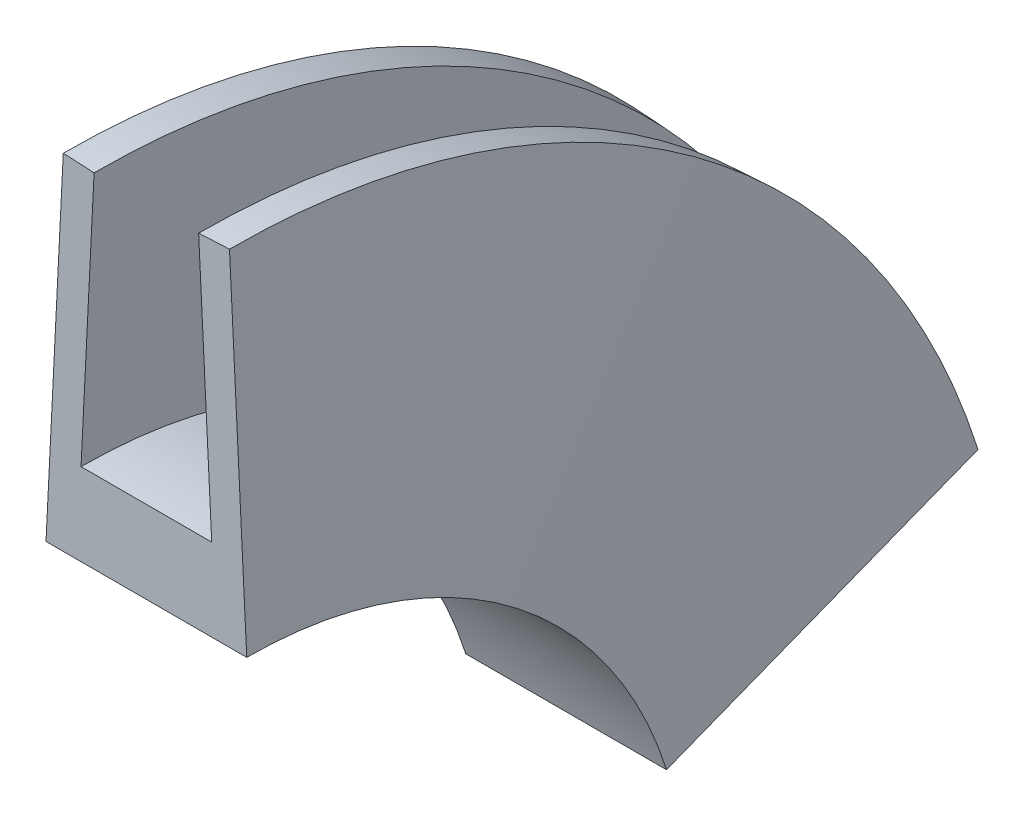
ISO-10303-21;
HEADER;
FILE_DESCRIPTION(('STEP AP214'),'2;1');
FILE_NAME('part.step','',(''),(''),'','','');
FILE_SCHEMA(('AUTOMOTIVE_DESIGN { 1 0 10303 214 1 1 1 1 }'));
ENDSEC;
DATA;
#1=APPLICATION_CONTEXT('core data for automotive mechanical design processes');
#2=APPLICATION_PROTOCOL_DEFINITION('international standard','automotive_design',2000,#1);
#3=PRODUCT_CONTEXT('',#1,'mechanical');
#4=PRODUCT('Part','Part','',(#3));
#5=PRODUCT_RELATED_PRODUCT_CATEGORY('part','',(#4));
#6=PRODUCT_DEFINITION_FORMATION('','',#4);
#7=PRODUCT_DEFINITION_CONTEXT('part definition',#1,'design');
#8=PRODUCT_DEFINITION('design','',#6,#7);
#9=PRODUCT_DEFINITION_SHAPE('','',#8);
#10=(LENGTH_UNIT() NAMED_UNIT(*) SI_UNIT(.MILLI.,.METRE.));
#11=(NAMED_UNIT(*) PLANE_ANGLE_UNIT() SI_UNIT($,.RADIAN.));
#12=(NAMED_UNIT(*) SI_UNIT($,.STERADIAN.) SOLID_ANGLE_UNIT());
#13=UNCERTAINTY_MEASURE_WITH_UNIT(LENGTH_MEASURE(1.E-05),#10,'distance_accuracy_value','');
#14=(GEOMETRIC_REPRESENTATION_CONTEXT(3) GLOBAL_UNCERTAINTY_ASSIGNED_CONTEXT((#13)) GLOBAL_UNIT_ASSIGNED_CONTEXT((#10,
#11,#12)) REPRESENTATION_CONTEXT('',''));
#15=CARTESIAN_POINT('',(0.,0.,0.));
#16=DIRECTION('',(0.,0.,1.));
#17=DIRECTION('',(1.,0.,0.));
#18=AXIS2_PLACEMENT_3D('',#15,#16,#17);
#19=CARTESIAN_POINT('',(0.,0.,0.));
#20=DIRECTION('',(0.,0.,1.));
#21=DIRECTION('',(1.,0.,0.));
#22=AXIS2_PLACEMENT_3D('',#19,#20,#21);
#23=PLANE('',#22);
#24=DIRECTION('',(-0.998749217771909,0.0499999999999996,0.));
#25=VECTOR('',#24,1.);
#26=CARTESIAN_POINT('',(-1.27,6.34205753285162,0.));
#27=LINE('',#26,#25);
#28=CARTESIAN_POINT('',(-1.27,6.34205753285162,0.));
#29=VERTEX_POINT('',#28);
#30=CARTESIAN_POINT('',(-2.01907309932017,6.37955809285162,0.));
#31=VERTEX_POINT('',#30);
#32=EDGE_CURVE('E114',#29,#31,#27,.T.);
#33=ORIENTED_EDGE('',*,*,#32,.T.);
#34=DIRECTION('',(-0.0499999999999999,-0.998749217771909,0.));
#35=VECTOR('',#34,1.);
#36=CARTESIAN_POINT('',(-2.01907309932017,6.37955809285162,0.));
#37=LINE('',#36,#35);
#38=CARTESIAN_POINT('',(-2.43857571037329,-2.,0.));
#39=VERTEX_POINT('',#38);
#40=EDGE_CURVE('E121',#31,#39,#37,.T.);
#41=ORIENTED_EDGE('',*,*,#40,.T.);
#42=DIRECTION('',(1.,0.,0.));
#43=VECTOR('',#42,1.);
#44=CARTESIAN_POINT('',(-2.43857571037329,-2.,0.));
#45=LINE('',#44,#43);
#46=CARTESIAN_POINT('',(2.4385757103733,-2.,0.));
#47=VERTEX_POINT('',#46);
#48=EDGE_CURVE('E131',#39,#47,#45,.T.);
#49=ORIENTED_EDGE('',*,*,#48,.T.);
#50=DIRECTION('',(-0.0500000000000001,0.998749217771909,0.));
#51=VECTOR('',#50,1.);
#52=CARTESIAN_POINT('',(2.4385757103733,-2.,0.));
#53=LINE('',#52,#51);
#54=CARTESIAN_POINT('',(2.01907309932017,6.37955809285162,0.));
#55=VERTEX_POINT('',#54);
#56=EDGE_CURVE('E140',#47,#55,#53,.T.);
#57=ORIENTED_EDGE('',*,*,#56,.T.);
#58=DIRECTION('',(-0.998749217771909,-0.0500000000000008,0.));
#59=VECTOR('',#58,1.);
#60=CARTESIAN_POINT('',(2.01907309932017,6.37955809285162,0.));
#61=LINE('',#60,#59);
#62=CARTESIAN_POINT('',(1.27,6.34205753285162,0.));
#63=VERTEX_POINT('',#62);
#64=EDGE_CURVE('E148',#55,#63,#61,.T.);
#65=ORIENTED_EDGE('',*,*,#64,.T.);
#66=DIRECTION('',(0.05,-0.998749217771909,0.));
#67=VECTOR('',#66,1.);
#68=CARTESIAN_POINT('',(1.27,6.34205753285162,0.));
#69=LINE('',#68,#67);
#70=CARTESIAN_POINT('',(1.5875,0.,0.));
#71=VERTEX_POINT('',#70);
#72=EDGE_CURVE('E84',#63,#71,#69,.T.);
#73=ORIENTED_EDGE('',*,*,#72,.T.);
#74=DIRECTION('',(-1.,0.,0.));
#75=VECTOR('',#74,1.);
#76=CARTESIAN_POINT('',(1.5875,0.,0.));
#77=LINE('',#76,#75);
#78=CARTESIAN_POINT('',(-1.5875,0.,0.));
#79=VERTEX_POINT('',#78);
#80=EDGE_CURVE('E79',#71,#79,#77,.T.);
#81=ORIENTED_EDGE('',*,*,#80,.T.);
#82=DIRECTION('',(0.05,0.998749217771909,0.));
#83=VECTOR('',#82,1.);
#84=CARTESIAN_POINT('',(-1.5875,0.,0.));
#85=LINE('',#84,#83);
#86=EDGE_CURVE('E73',#79,#29,#85,.T.);
#87=ORIENTED_EDGE('',*,*,#86,.T.);
#88=EDGE_LOOP('',(#33,#41,#49,#57,#65,#73,#81,#87));
#89=FACE_BOUND('',#88,.T.);
#90=ADVANCED_FACE('F37',(#89),#23,.T.);
#91=CARTESIAN_POINT('',(0.,-8.85826771653543,-12.105002811325));
#92=DIRECTION('',(0.,0.953149827663386,0.30249860499721));
#93=DIRECTION('',(1.,0.,0.));
#94=AXIS2_PLACEMENT_3D('',#91,#92,#93);
#95=PLANE('',#94);
#96=DIRECTION('',(-0.998749217771909,0.0151249302498604,-0.0476574913831689));
#97=VECTOR('',#96,1.);
#98=CARTESIAN_POINT('',(-1.27,-6.93980416003577,-18.1499338557938));
#99=LINE('',#98,#97);
#100=CARTESIAN_POINT('',(-1.27,-6.93980416003577,-18.1499338557938));
#101=VERTEX_POINT('',#100);
#102=CARTESIAN_POINT('',(-2.01907309932017,-6.92846029294915,-18.1856775080951));
#103=VERTEX_POINT('',#102);
#104=EDGE_CURVE('E125',#101,#103,#99,.T.);
#105=ORIENTED_EDGE('',*,*,#104,.F.);
#106=DIRECTION('',(0.05,0.302120245118057,-0.951957644798236));
#107=VECTOR('',#106,1.);
#108=CARTESIAN_POINT('',(-1.5875,-8.85826771653543,-12.105002811325));
#109=LINE('',#108,#107);
#110=CARTESIAN_POINT('',(-1.5875,-8.85826771653543,-12.105002811325));
#111=VERTEX_POINT('',#110);
#112=EDGE_CURVE('E11',#111,#101,#109,.T.);
#113=ORIENTED_EDGE('',*,*,#112,.F.);
#114=DIRECTION('',(-1.,0.,0.));
#115=VECTOR('',#114,1.);
#116=CARTESIAN_POINT('',(1.5875,-8.85826771653543,-12.105002811325));
#117=LINE('',#116,#115);
#118=CARTESIAN_POINT('',(1.5875,-8.85826771653543,-12.105002811325));
#119=VERTEX_POINT('',#118);
#120=EDGE_CURVE('E51',#119,#111,#117,.T.);
#121=ORIENTED_EDGE('',*,*,#120,.F.);
#122=DIRECTION('',(0.05,-0.302120245118057,0.951957644798236));
#123=VECTOR('',#122,1.);
#124=CARTESIAN_POINT('',(1.27,-6.93980416003577,-18.1499338557938));
#125=LINE('',#124,#123);
#126=CARTESIAN_POINT('',(1.27,-6.93980416003577,-18.1499338557938));
#127=VERTEX_POINT('',#126);
#128=EDGE_CURVE('E60',#127,#119,#125,.T.);
#129=ORIENTED_EDGE('',*,*,#128,.F.);
#130=DIRECTION('',(-0.998749217771909,-0.0151249302498607,0.04765749138317));
#131=VECTOR('',#130,1.);
#132=CARTESIAN_POINT('',(2.01907309932017,-6.92846029294915,-18.1856775080951));
#133=LINE('',#132,#131);
#134=CARTESIAN_POINT('',(2.01907309932017,-6.92846029294915,-18.1856775080951));
#135=VERTEX_POINT('',#134);
#136=EDGE_CURVE('E153',#135,#127,#133,.T.);
#137=ORIENTED_EDGE('',*,*,#136,.F.);
#138=DIRECTION('',(-0.0500000000000001,0.302120245118057,-0.951957644798236));
#139=VECTOR('',#138,1.);
#140=CARTESIAN_POINT('',(2.4385757103733,-9.46326492652985,-10.1987031559982));
#141=LINE('',#140,#139);
#142=CARTESIAN_POINT('',(2.4385757103733,-9.46326492652985,-10.1987031559982));
#143=VERTEX_POINT('',#142);
#144=EDGE_CURVE('E145',#143,#135,#141,.T.);
#145=ORIENTED_EDGE('',*,*,#144,.F.);
#146=DIRECTION('',(1.,0.,0.));
#147=VECTOR('',#146,1.);
#148=CARTESIAN_POINT('',(-2.43857571037329,-9.46326492652985,-10.1987031559982));
#149=LINE('',#148,#147);
#150=CARTESIAN_POINT('',(-2.43857571037329,-9.46326492652985,-10.1987031559982));
#151=VERTEX_POINT('',#150);
#152=EDGE_CURVE('E137',#151,#143,#149,.T.);
#153=ORIENTED_EDGE('',*,*,#152,.F.);
#154=DIRECTION('',(-0.0499999999999999,-0.302120245118057,0.951957644798236));
#155=VECTOR('',#154,1.);
#156=CARTESIAN_POINT('',(-2.01907309932017,-6.92846029294915,-18.1856775080951));
#157=LINE('',#156,#155);
#158=EDGE_CURVE('E132',#103,#151,#157,.T.);
#159=ORIENTED_EDGE('',*,*,#158,.F.);
#160=EDGE_LOOP('',(#105,#113,#121,#129,#137,#145,#153,#159));
#161=FACE_BOUND('',#160,.T.);
#162=ADVANCED_FACE('F176',(#161),#95,.F.);
#163=CARTESIAN_POINT('',(-1.27,-12.7,0.));
#164=DIRECTION('',(-1.,0.,0.));
#165=DIRECTION('',(0.,0.,1.));
#166=AXIS2_PLACEMENT_3D('',#163,#164,#165);
#167=CONICAL_SURFACE('',#166,19.0420575328516,0.0500208568057708);
#168=CARTESIAN_POINT('',(-2.01907309932017,-12.7,0.));
#169=DIRECTION('',(-1.,0.,0.));
#170=DIRECTION('',(0.,1.,0.));
#171=AXIS2_PLACEMENT_3D('',#168,#169,#170);
#172=CIRCLE('',#171,19.0795580928516);
#173=EDGE_CURVE('E118',#31,#103,#172,.T.);
#174=ORIENTED_EDGE('',*,*,#173,.F.);
#175=ORIENTED_EDGE('',*,*,#32,.F.);
#176=CARTESIAN_POINT('',(-1.27,-12.7,0.));
#177=DIRECTION('',(-1.,0.,0.));
#178=DIRECTION('',(0.,1.,0.));
#179=AXIS2_PLACEMENT_3D('',#176,#177,#178);
#180=CIRCLE('',#179,19.0420575328516);
#181=EDGE_CURVE('E116',#29,#101,#180,.T.);
#182=ORIENTED_EDGE('',*,*,#181,.T.);
#183=ORIENTED_EDGE('',*,*,#104,.T.);
#184=EDGE_LOOP('',(#174,#175,#182,#183));
#185=FACE_BOUND('',#184,.T.);
#186=ADVANCED_FACE('F115',(#185),#167,.T.);
#187=CARTESIAN_POINT('',(-2.01907309932017,-12.7,0.));
#188=DIRECTION('',(1.,0.,0.));
#189=DIRECTION('',(0.,0.,-1.));
#190=AXIS2_PLACEMENT_3D('',#187,#188,#189);
#191=CONICAL_SURFACE('',#190,19.0795580928516,1.52077546998913);
#192=CARTESIAN_POINT('',(-2.43857571037329,-12.7,0.));
#193=DIRECTION('',(-1.,0.,0.));
#194=DIRECTION('',(0.,1.,0.));
#195=AXIS2_PLACEMENT_3D('',#192,#193,#194);
#196=CIRCLE('',#195,10.7);
#197=EDGE_CURVE('E134',#39,#151,#196,.T.);
#198=ORIENTED_EDGE('',*,*,#197,.F.);
#199=ORIENTED_EDGE('',*,*,#40,.F.);
#200=ORIENTED_EDGE('',*,*,#173,.T.);
#201=ORIENTED_EDGE('',*,*,#158,.T.);
#202=EDGE_LOOP('',(#198,#199,#200,#201));
#203=FACE_BOUND('',#202,.T.);
#204=ADVANCED_FACE('F183',(#203),#191,.T.);
#205=CARTESIAN_POINT('',(0.,-12.7,0.));
#206=DIRECTION('',(-1.,0.,0.));
#207=DIRECTION('',(0.,0.,1.));
#208=AXIS2_PLACEMENT_3D('',#205,#206,#207);
#209=CYLINDRICAL_SURFACE('',#208,10.7);
#210=CARTESIAN_POINT('',(2.4385757103733,-12.7,0.));
#211=DIRECTION('',(-1.,0.,0.));
#212=DIRECTION('',(0.,1.,0.));
#213=AXIS2_PLACEMENT_3D('',#210,#211,#212);
#214=CIRCLE('',#213,10.7);
#215=EDGE_CURVE('E142',#47,#143,#214,.T.);
#216=ORIENTED_EDGE('',*,*,#215,.F.);
#217=ORIENTED_EDGE('',*,*,#48,.F.);
#218=ORIENTED_EDGE('',*,*,#197,.T.);
#219=ORIENTED_EDGE('',*,*,#152,.T.);
#220=EDGE_LOOP('',(#216,#217,#218,#219));
#221=FACE_BOUND('',#220,.T.);
#222=ADVANCED_FACE('F193',(#221),#209,.F.);
#223=CARTESIAN_POINT('',(2.4385757103733,-12.7,0.));
#224=DIRECTION('',(-1.,0.,0.));
#225=DIRECTION('',(0.,0.,1.));
#226=AXIS2_PLACEMENT_3D('',#223,#224,#225);
#227=CONICAL_SURFACE('',#226,10.7,1.52077546998913);
#228=CARTESIAN_POINT('',(2.01907309932017,-12.7,0.));
#229=DIRECTION('',(-1.,0.,0.));
#230=DIRECTION('',(0.,1.,0.));
#231=AXIS2_PLACEMENT_3D('',#228,#229,#230);
#232=CIRCLE('',#231,19.0795580928516);
#233=EDGE_CURVE('E150',#55,#135,#232,.T.);
#234=ORIENTED_EDGE('',*,*,#233,.F.);
#235=ORIENTED_EDGE('',*,*,#56,.F.);
#236=ORIENTED_EDGE('',*,*,#215,.T.);
#237=ORIENTED_EDGE('',*,*,#144,.T.);
#238=EDGE_LOOP('',(#234,#235,#236,#237));
#239=FACE_BOUND('',#238,.T.);
#240=ADVANCED_FACE('F195',(#239),#227,.T.);
#241=CARTESIAN_POINT('',(2.01907309932017,-12.7,0.));
#242=DIRECTION('',(1.,0.,0.));
#243=DIRECTION('',(0.,0.,-1.));
#244=AXIS2_PLACEMENT_3D('',#241,#242,#243);
#245=CONICAL_SURFACE('',#244,19.0795580928516,0.0500208568057708);
#246=CARTESIAN_POINT('',(1.27,-12.7,0.));
#247=DIRECTION('',(-1.,0.,0.));
#248=DIRECTION('',(0.,1.,0.));
#249=AXIS2_PLACEMENT_3D('',#246,#247,#248);
#250=CIRCLE('',#249,19.0420575328516);
#251=EDGE_CURVE('E156',#63,#127,#250,.T.);
#252=ORIENTED_EDGE('',*,*,#251,.F.);
#253=ORIENTED_EDGE('',*,*,#64,.F.);
#254=ORIENTED_EDGE('',*,*,#233,.T.);
#255=ORIENTED_EDGE('',*,*,#136,.T.);
#256=EDGE_LOOP('',(#252,#253,#254,#255));
#257=FACE_BOUND('',#256,.T.);
#258=ADVANCED_FACE('F173',(#257),#245,.T.);
#259=CARTESIAN_POINT('',(1.27,-12.7,0.));
#260=DIRECTION('',(-1.,0.,0.));
#261=DIRECTION('',(0.,0.,1.));
#262=AXIS2_PLACEMENT_3D('',#259,#260,#261);
#263=CONICAL_SURFACE('',#262,19.0420575328516,1.52077546998913);
#264=CARTESIAN_POINT('',(1.5875,-12.7,0.));
#265=DIRECTION('',(-1.,0.,0.));
#266=DIRECTION('',(0.,1.,0.));
#267=AXIS2_PLACEMENT_3D('',#264,#265,#266);
#268=CIRCLE('',#267,12.7);
#269=EDGE_CURVE('E160',#71,#119,#268,.T.);
#270=ORIENTED_EDGE('',*,*,#269,.F.);
#271=ORIENTED_EDGE('',*,*,#72,.F.);
#272=ORIENTED_EDGE('',*,*,#251,.T.);
#273=ORIENTED_EDGE('',*,*,#128,.T.);
#274=EDGE_LOOP('',(#270,#271,#272,#273));
#275=FACE_BOUND('',#274,.T.);
#276=ADVANCED_FACE('F166',(#275),#263,.F.);
#277=CARTESIAN_POINT('',(0.,-12.7,0.));
#278=DIRECTION('',(-1.,0.,0.));
#279=DIRECTION('',(0.,0.,1.));
#280=AXIS2_PLACEMENT_3D('',#277,#278,#279);
#281=CYLINDRICAL_SURFACE('',#280,12.7);
#282=CARTESIAN_POINT('',(-1.5875,-12.7,0.));
#283=DIRECTION('',(-1.,0.,0.));
#284=DIRECTION('',(0.,1.,0.));
#285=AXIS2_PLACEMENT_3D('',#282,#283,#284);
#286=CIRCLE('',#285,12.7);
#287=EDGE_CURVE('E44',#79,#111,#286,.T.);
#288=ORIENTED_EDGE('',*,*,#287,.F.);
#289=ORIENTED_EDGE('',*,*,#80,.F.);
#290=ORIENTED_EDGE('',*,*,#269,.T.);
#291=ORIENTED_EDGE('',*,*,#120,.T.);
#292=EDGE_LOOP('',(#288,#289,#290,#291));
#293=FACE_BOUND('',#292,.T.);
#294=ADVANCED_FACE('F164',(#293),#281,.T.);
#295=CARTESIAN_POINT('',(-1.5875,-12.7,0.));
#296=DIRECTION('',(1.,0.,0.));
#297=DIRECTION('',(0.,0.,-1.));
#298=AXIS2_PLACEMENT_3D('',#295,#296,#297);
#299=CONICAL_SURFACE('',#298,12.7,1.52077546998913);
#300=ORIENTED_EDGE('',*,*,#112,.T.);
#301=ORIENTED_EDGE('',*,*,#181,.F.);
#302=ORIENTED_EDGE('',*,*,#86,.F.);
#303=ORIENTED_EDGE('',*,*,#287,.T.);
#304=EDGE_LOOP('',(#300,#301,#302,#303));
#305=FACE_BOUND('',#304,.T.);
#306=ADVANCED_FACE('F123',(#305),#299,.F.);
#307=CLOSED_SHELL('',(#90,#162,#186,#204,#222,#240,#258,#276,#294,#306));
#308=MANIFOLD_SOLID_BREP('B2',#307);
#309=ADVANCED_BREP_SHAPE_REPRESENTATION('',(#18,#308),#14);
#310=SHAPE_DEFINITION_REPRESENTATION(#9,#309);
ENDSEC;
END-ISO-10303-21;
